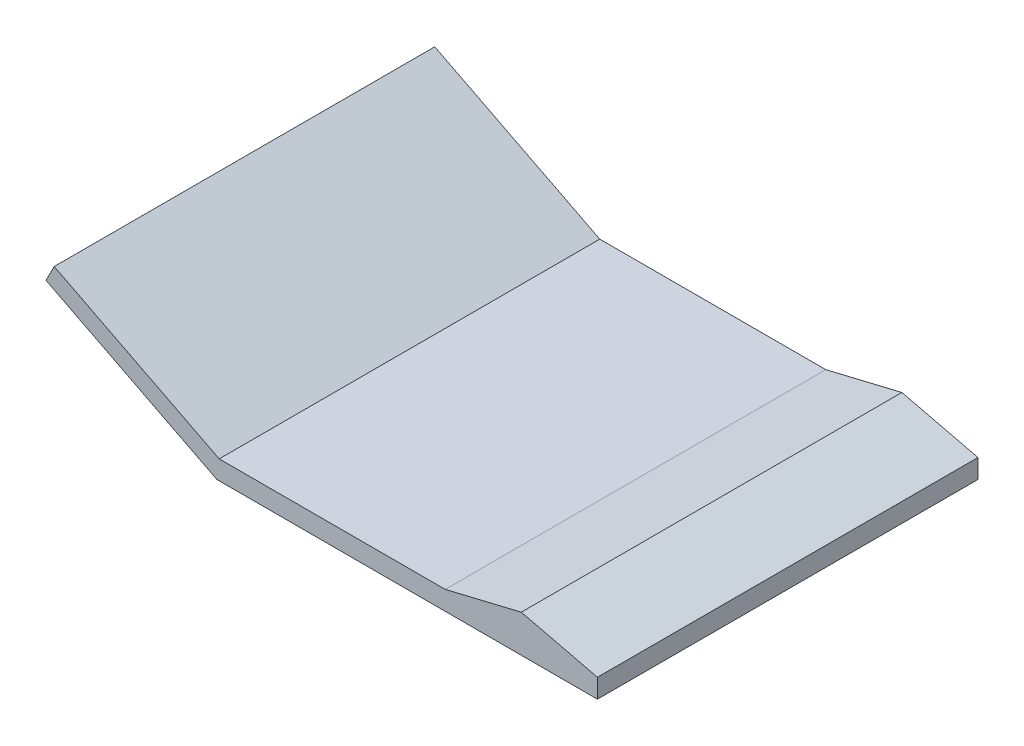
ISO-10303-21;
HEADER;
FILE_DESCRIPTION(('STEP AP214'),'2;1');
FILE_NAME('part.step','',(''),(''),'','','');
FILE_SCHEMA(('AUTOMOTIVE_DESIGN { 1 0 10303 214 1 1 1 1 }'));
ENDSEC;
DATA;
#1=APPLICATION_CONTEXT('core data for automotive mechanical design processes');
#2=APPLICATION_PROTOCOL_DEFINITION('international standard','automotive_design',2000,#1);
#3=PRODUCT_CONTEXT('',#1,'mechanical');
#4=PRODUCT('Part','Part','',(#3));
#5=PRODUCT_RELATED_PRODUCT_CATEGORY('part','',(#4));
#6=PRODUCT_DEFINITION_FORMATION('','',#4);
#7=PRODUCT_DEFINITION_CONTEXT('part definition',#1,'design');
#8=PRODUCT_DEFINITION('design','',#6,#7);
#9=PRODUCT_DEFINITION_SHAPE('','',#8);
#10=(LENGTH_UNIT() NAMED_UNIT(*) SI_UNIT(.MILLI.,.METRE.));
#11=(NAMED_UNIT(*) PLANE_ANGLE_UNIT() SI_UNIT($,.RADIAN.));
#12=(NAMED_UNIT(*) SI_UNIT($,.STERADIAN.) SOLID_ANGLE_UNIT());
#13=UNCERTAINTY_MEASURE_WITH_UNIT(LENGTH_MEASURE(1.E-05),#10,'distance_accuracy_value','');
#14=(GEOMETRIC_REPRESENTATION_CONTEXT(3) GLOBAL_UNCERTAINTY_ASSIGNED_CONTEXT((#13)) GLOBAL_UNIT_ASSIGNED_CONTEXT((#10,
#11,#12)) REPRESENTATION_CONTEXT('',''));
#15=CARTESIAN_POINT('',(0.,0.,0.));
#16=DIRECTION('',(0.,0.,1.));
#17=DIRECTION('',(1.,0.,0.));
#18=AXIS2_PLACEMENT_3D('',#15,#16,#17);
#19=CARTESIAN_POINT('',(102.931698218581,20.,400.));
#20=DIRECTION('',(0.,1.,0.));
#21=DIRECTION('',(0.,0.,1.));
#22=AXIS2_PLACEMENT_3D('',#19,#20,#21);
#23=PLANE('',#22);
#24=DIRECTION('',(1.,0.,0.));
#25=VECTOR('',#24,1.);
#26=CARTESIAN_POINT('',(102.931698218581,20.,0.));
#27=LINE('',#26,#25);
#28=CARTESIAN_POINT('',(2.48047316552984,20.,0.));
#29=VERTEX_POINT('',#28);
#30=CARTESIAN_POINT('',(240.,20.,0.));
#31=VERTEX_POINT('',#30);
#32=EDGE_CURVE('E130',#29,#31,#27,.T.);
#33=ORIENTED_EDGE('',*,*,#32,.F.);
#34=DIRECTION('',(0.,0.,-1.));
#35=VECTOR('',#34,1.);
#36=CARTESIAN_POINT('',(2.48047316552984,20.,400.));
#37=LINE('',#36,#35);
#38=CARTESIAN_POINT('',(2.48047316552984,20.,400.));
#39=VERTEX_POINT('',#38);
#40=EDGE_CURVE('E11',#39,#29,#37,.T.);
#41=ORIENTED_EDGE('',*,*,#40,.F.);
#42=DIRECTION('',(1.,0.,0.));
#43=VECTOR('',#42,1.);
#44=CARTESIAN_POINT('',(102.931698218581,20.,400.));
#45=LINE('',#44,#43);
#46=CARTESIAN_POINT('',(240.,20.,400.));
#47=VERTEX_POINT('',#46);
#48=EDGE_CURVE('E148',#39,#47,#45,.T.);
#49=ORIENTED_EDGE('',*,*,#48,.T.);
#50=DIRECTION('',(0.,0.,-1.));
#51=VECTOR('',#50,1.);
#52=CARTESIAN_POINT('',(240.,20.,400.));
#53=LINE('',#52,#51);
#54=EDGE_CURVE('E87',#47,#31,#53,.T.);
#55=ORIENTED_EDGE('',*,*,#54,.T.);
#56=EDGE_LOOP('',(#33,#41,#49,#55));
#57=FACE_BOUND('',#56,.T.);
#58=ADVANCED_FACE('F36',(#57),#23,.T.);
#59=CARTESIAN_POINT('',(269.093255223092,-115.845997618839,400.));
#60=DIRECTION('',(-0.453990499739544,-0.891006524188369,0.));
#61=DIRECTION('',(0.891006524188369,-0.453990499739544,0.));
#62=AXIS2_PLACEMENT_3D('',#59,#60,#61);
#63=PLANE('',#62);
#64=DIRECTION('',(-0.891006524188369,0.453990499739544,0.));
#65=VECTOR('',#64,1.);
#66=CARTESIAN_POINT('',(269.093255223092,-115.845997618839,0.));
#67=LINE('',#66,#65);
#68=CARTESIAN_POINT('',(-170.957150211643,108.370883010499,0.));
#69=VERTEX_POINT('',#68);
#70=EDGE_CURVE('E133',#29,#69,#67,.T.);
#71=ORIENTED_EDGE('',*,*,#70,.T.);
#72=DIRECTION('',(0.,0.,-1.));
#73=VECTOR('',#72,1.);
#74=CARTESIAN_POINT('',(-170.957150211643,108.370883010499,400.));
#75=LINE('',#74,#73);
#76=CARTESIAN_POINT('',(-170.957150211643,108.370883010499,400.));
#77=VERTEX_POINT('',#76);
#78=EDGE_CURVE('E44',#77,#69,#75,.T.);
#79=ORIENTED_EDGE('',*,*,#78,.F.);
#80=DIRECTION('',(-0.891006524188369,0.453990499739544,0.));
#81=VECTOR('',#80,1.);
#82=CARTESIAN_POINT('',(269.093255223092,-115.845997618839,400.));
#83=LINE('',#82,#81);
#84=EDGE_CURVE('E173',#39,#77,#83,.T.);
#85=ORIENTED_EDGE('',*,*,#84,.F.);
#86=ORIENTED_EDGE('',*,*,#40,.T.);
#87=EDGE_LOOP('',(#71,#79,#85,#86));
#88=FACE_BOUND('',#87,.T.);
#89=ADVANCED_FACE('F164',(#88),#63,.F.);
#90=CARTESIAN_POINT('',(-337.118707216154,-217.73953437765,400.));
#91=DIRECTION('',(-0.891006524188369,0.453990499739545,0.));
#92=DIRECTION('',(-0.453990499739545,-0.891006524188369,0.));
#93=AXIS2_PLACEMENT_3D('',#90,#91,#92);
#94=PLANE('',#93);
#95=DIRECTION('',(0.453990499739545,0.891006524188369,0.));
#96=VECTOR('',#95,1.);
#97=CARTESIAN_POINT('',(-337.118707216154,-217.73953437765,0.));
#98=LINE('',#97,#96);
#99=CARTESIAN_POINT('',(-179.558563965454,91.4896580150716,0.));
#100=VERTEX_POINT('',#99);
#101=EDGE_CURVE('E136',#100,#69,#98,.T.);
#102=ORIENTED_EDGE('',*,*,#101,.F.);
#103=DIRECTION('',(0.,0.,-1.));
#104=VECTOR('',#103,1.);
#105=CARTESIAN_POINT('',(-179.558563965454,91.4896580150716,400.));
#106=LINE('',#105,#104);
#107=CARTESIAN_POINT('',(-179.558563965454,91.4896580150716,400.));
#108=VERTEX_POINT('',#107);
#109=EDGE_CURVE('E154',#108,#100,#106,.T.);
#110=ORIENTED_EDGE('',*,*,#109,.F.);
#111=DIRECTION('',(0.453990499739545,0.891006524188369,0.));
#112=VECTOR('',#111,1.);
#113=CARTESIAN_POINT('',(-337.118707216154,-217.73953437765,400.));
#114=LINE('',#113,#112);
#115=EDGE_CURVE('E161',#108,#77,#114,.T.);
#116=ORIENTED_EDGE('',*,*,#115,.T.);
#117=ORIENTED_EDGE('',*,*,#78,.T.);
#118=EDGE_LOOP('',(#102,#110,#116,#117));
#119=FACE_BOUND('',#118,.T.);
#120=ADVANCED_FACE('F159',(#119),#94,.T.);
#121=CARTESIAN_POINT('',(260.491841469281,-132.727222614266,400.));
#122=DIRECTION('',(-0.453990499739544,-0.891006524188369,0.));
#123=DIRECTION('',(0.891006524188369,-0.453990499739544,0.));
#124=AXIS2_PLACEMENT_3D('',#121,#122,#123);
#125=PLANE('',#124);
#126=DIRECTION('',(-0.891006524188369,0.453990499739544,0.));
#127=VECTOR('',#126,1.);
#128=CARTESIAN_POINT('',(260.491841469281,-132.727222614266,0.));
#129=LINE('',#128,#127);
#130=CARTESIAN_POINT('',(0.,0.,0.));
#131=VERTEX_POINT('',#130);
#132=EDGE_CURVE('E139',#131,#100,#129,.T.);
#133=ORIENTED_EDGE('',*,*,#132,.F.);
#134=DIRECTION('',(0.,0.,-1.));
#135=VECTOR('',#134,1.);
#136=CARTESIAN_POINT('',(0.,0.,400.));
#137=LINE('',#136,#135);
#138=CARTESIAN_POINT('',(0.,0.,400.));
#139=VERTEX_POINT('',#138);
#140=EDGE_CURVE('E152',#139,#131,#137,.T.);
#141=ORIENTED_EDGE('',*,*,#140,.F.);
#142=DIRECTION('',(-0.891006524188369,0.453990499739544,0.));
#143=VECTOR('',#142,1.);
#144=CARTESIAN_POINT('',(260.491841469281,-132.727222614266,400.));
#145=LINE('',#144,#143);
#146=EDGE_CURVE('E172',#139,#108,#145,.T.);
#147=ORIENTED_EDGE('',*,*,#146,.T.);
#148=ORIENTED_EDGE('',*,*,#109,.T.);
#149=EDGE_LOOP('',(#133,#141,#147,#148));
#150=FACE_BOUND('',#149,.T.);
#151=ADVANCED_FACE('F170',(#150),#125,.T.);
#152=CARTESIAN_POINT('',(102.931698218581,0.,400.));
#153=DIRECTION('',(0.,1.,0.));
#154=DIRECTION('',(0.,0.,1.));
#155=AXIS2_PLACEMENT_3D('',#152,#153,#154);
#156=PLANE('',#155);
#157=DIRECTION('',(1.,0.,0.));
#158=VECTOR('',#157,1.);
#159=CARTESIAN_POINT('',(102.931698218581,0.,0.));
#160=LINE('',#159,#158);
#161=CARTESIAN_POINT('',(400.,0.,0.));
#162=VERTEX_POINT('',#161);
#163=EDGE_CURVE('E142',#131,#162,#160,.T.);
#164=ORIENTED_EDGE('',*,*,#163,.T.);
#165=DIRECTION('',(0.,0.,-1.));
#166=VECTOR('',#165,1.);
#167=CARTESIAN_POINT('',(400.,0.,400.));
#168=LINE('',#167,#166);
#169=CARTESIAN_POINT('',(400.,0.,400.));
#170=VERTEX_POINT('',#169);
#171=EDGE_CURVE('E122',#170,#162,#168,.T.);
#172=ORIENTED_EDGE('',*,*,#171,.F.);
#173=DIRECTION('',(1.,0.,0.));
#174=VECTOR('',#173,1.);
#175=CARTESIAN_POINT('',(102.931698218581,0.,400.));
#176=LINE('',#175,#174);
#177=EDGE_CURVE('E113',#139,#170,#176,.T.);
#178=ORIENTED_EDGE('',*,*,#177,.F.);
#179=ORIENTED_EDGE('',*,*,#140,.T.);
#180=EDGE_LOOP('',(#164,#172,#178,#179));
#181=FACE_BOUND('',#180,.T.);
#182=ADVANCED_FACE('F189',(#181),#156,.F.);
#183=CARTESIAN_POINT('',(400.,-441.956415006988,400.));
#184=DIRECTION('',(-1.,0.,0.));
#185=DIRECTION('',(0.,0.,1.));
#186=AXIS2_PLACEMENT_3D('',#183,#184,#185);
#187=PLANE('',#186);
#188=DIRECTION('',(0.,1.,0.));
#189=VECTOR('',#188,1.);
#190=CARTESIAN_POINT('',(400.,-441.956415006988,0.));
#191=LINE('',#190,#189);
#192=CARTESIAN_POINT('',(400.,20.,0.));
#193=VERTEX_POINT('',#192);
#194=EDGE_CURVE('E121',#162,#193,#191,.T.);
#195=ORIENTED_EDGE('',*,*,#194,.T.);
#196=DIRECTION('',(0.,0.,-1.));
#197=VECTOR('',#196,1.);
#198=CARTESIAN_POINT('',(400.,20.,400.));
#199=LINE('',#198,#197);
#200=CARTESIAN_POINT('',(400.,20.,400.));
#201=VERTEX_POINT('',#200);
#202=EDGE_CURVE('E118',#201,#193,#199,.T.);
#203=ORIENTED_EDGE('',*,*,#202,.F.);
#204=DIRECTION('',(0.,1.,0.));
#205=VECTOR('',#204,1.);
#206=CARTESIAN_POINT('',(400.,-441.956415006988,400.));
#207=LINE('',#206,#205);
#208=EDGE_CURVE('E106',#170,#201,#207,.T.);
#209=ORIENTED_EDGE('',*,*,#208,.F.);
#210=ORIENTED_EDGE('',*,*,#171,.T.);
#211=EDGE_LOOP('',(#195,#203,#209,#210));
#212=FACE_BOUND('',#211,.T.);
#213=ADVANCED_FACE('F119',(#212),#187,.F.);
#214=CARTESIAN_POINT('',(223.982863454345,62.2579757187163,400.));
#215=DIRECTION('',(-0.233445363855906,-0.972369920397677,0.));
#216=DIRECTION('',(0.972369920397677,-0.233445363855906,0.));
#217=AXIS2_PLACEMENT_3D('',#214,#215,#216);
#218=PLANE('',#217);
#219=DIRECTION('',(-0.972369920397677,0.233445363855906,0.));
#220=VECTOR('',#219,1.);
#221=CARTESIAN_POINT('',(223.982863454345,62.2579757187163,0.));
#222=LINE('',#221,#220);
#223=CARTESIAN_POINT('',(320.,39.2063007264093,0.));
#224=VERTEX_POINT('',#223);
#225=EDGE_CURVE('E80',#193,#224,#222,.T.);
#226=ORIENTED_EDGE('',*,*,#225,.T.);
#227=DIRECTION('',(0.,0.,-1.));
#228=VECTOR('',#227,1.);
#229=CARTESIAN_POINT('',(320.,39.2063007264093,400.));
#230=LINE('',#229,#228);
#231=CARTESIAN_POINT('',(320.,39.2063007264093,400.));
#232=VERTEX_POINT('',#231);
#233=EDGE_CURVE('E123',#232,#224,#230,.T.);
#234=ORIENTED_EDGE('',*,*,#233,.F.);
#235=DIRECTION('',(-0.972369920397677,0.233445363855906,0.));
#236=VECTOR('',#235,1.);
#237=CARTESIAN_POINT('',(223.982863454345,62.2579757187163,400.));
#238=LINE('',#237,#236);
#239=EDGE_CURVE('E110',#201,#232,#238,.T.);
#240=ORIENTED_EDGE('',*,*,#239,.F.);
#241=ORIENTED_EDGE('',*,*,#202,.T.);
#242=EDGE_LOOP('',(#226,#234,#240,#241));
#243=FACE_BOUND('',#242,.T.);
#244=ADVANCED_FACE('F125',(#243),#218,.F.);
#245=CARTESIAN_POINT('',(5.53956168250233,-36.2889710846451,400.));
#246=DIRECTION('',(0.233445363855906,-0.972369920397677,0.));
#247=DIRECTION('',(0.972369920397677,0.233445363855906,0.));
#248=AXIS2_PLACEMENT_3D('',#245,#246,#247);
#249=PLANE('',#248);
#250=DIRECTION('',(-0.972369920397677,-0.233445363855906,0.));
#251=VECTOR('',#250,1.);
#252=CARTESIAN_POINT('',(5.53956168250233,-36.2889710846451,0.));
#253=LINE('',#252,#251);
#254=EDGE_CURVE('E146',#224,#31,#253,.T.);
#255=ORIENTED_EDGE('',*,*,#254,.T.);
#256=ORIENTED_EDGE('',*,*,#54,.F.);
#257=DIRECTION('',(-0.972369920397677,-0.233445363855906,0.));
#258=VECTOR('',#257,1.);
#259=CARTESIAN_POINT('',(5.53956168250233,-36.2889710846451,400.));
#260=LINE('',#259,#258);
#261=EDGE_CURVE('E52',#232,#47,#260,.T.);
#262=ORIENTED_EDGE('',*,*,#261,.F.);
#263=ORIENTED_EDGE('',*,*,#233,.T.);
#264=EDGE_LOOP('',(#255,#256,#262,#263));
#265=FACE_BOUND('',#264,.T.);
#266=ADVANCED_FACE('F197',(#265),#249,.F.);
#267=CARTESIAN_POINT('',(102.931698218581,-441.956415006988,400.));
#268=DIRECTION('',(0.,0.,1.));
#269=DIRECTION('',(1.,0.,0.));
#270=AXIS2_PLACEMENT_3D('',#267,#268,#269);
#271=PLANE('',#270);
#272=ORIENTED_EDGE('',*,*,#48,.F.);
#273=ORIENTED_EDGE('',*,*,#84,.T.);
#274=ORIENTED_EDGE('',*,*,#115,.F.);
#275=ORIENTED_EDGE('',*,*,#146,.F.);
#276=ORIENTED_EDGE('',*,*,#177,.T.);
#277=ORIENTED_EDGE('',*,*,#208,.T.);
#278=ORIENTED_EDGE('',*,*,#239,.T.);
#279=ORIENTED_EDGE('',*,*,#261,.T.);
#280=EDGE_LOOP('',(#272,#273,#274,#275,#276,#277,#278,#279));
#281=FACE_BOUND('',#280,.T.);
#282=ADVANCED_FACE('F108',(#281),#271,.T.);
#283=CARTESIAN_POINT('',(102.931698218581,-441.956415006988,0.));
#284=DIRECTION('',(0.,0.,1.));
#285=DIRECTION('',(1.,0.,0.));
#286=AXIS2_PLACEMENT_3D('',#283,#284,#285);
#287=PLANE('',#286);
#288=ORIENTED_EDGE('',*,*,#32,.T.);
#289=ORIENTED_EDGE('',*,*,#254,.F.);
#290=ORIENTED_EDGE('',*,*,#225,.F.);
#291=ORIENTED_EDGE('',*,*,#194,.F.);
#292=ORIENTED_EDGE('',*,*,#163,.F.);
#293=ORIENTED_EDGE('',*,*,#132,.T.);
#294=ORIENTED_EDGE('',*,*,#101,.T.);
#295=ORIENTED_EDGE('',*,*,#70,.F.);
#296=EDGE_LOOP('',(#288,#289,#290,#291,#292,#293,#294,#295));
#297=FACE_BOUND('',#296,.T.);
#298=ADVANCED_FACE('F166',(#297),#287,.F.);
#299=CLOSED_SHELL('',(#58,#89,#120,#151,#182,#213,#244,#266,#282,#298));
#300=MANIFOLD_SOLID_BREP('B2',#299);
#301=ADVANCED_BREP_SHAPE_REPRESENTATION('',(#18,#300),#14);
#302=SHAPE_DEFINITION_REPRESENTATION(#9,#301);
ENDSEC;
END-ISO-10303-21;
